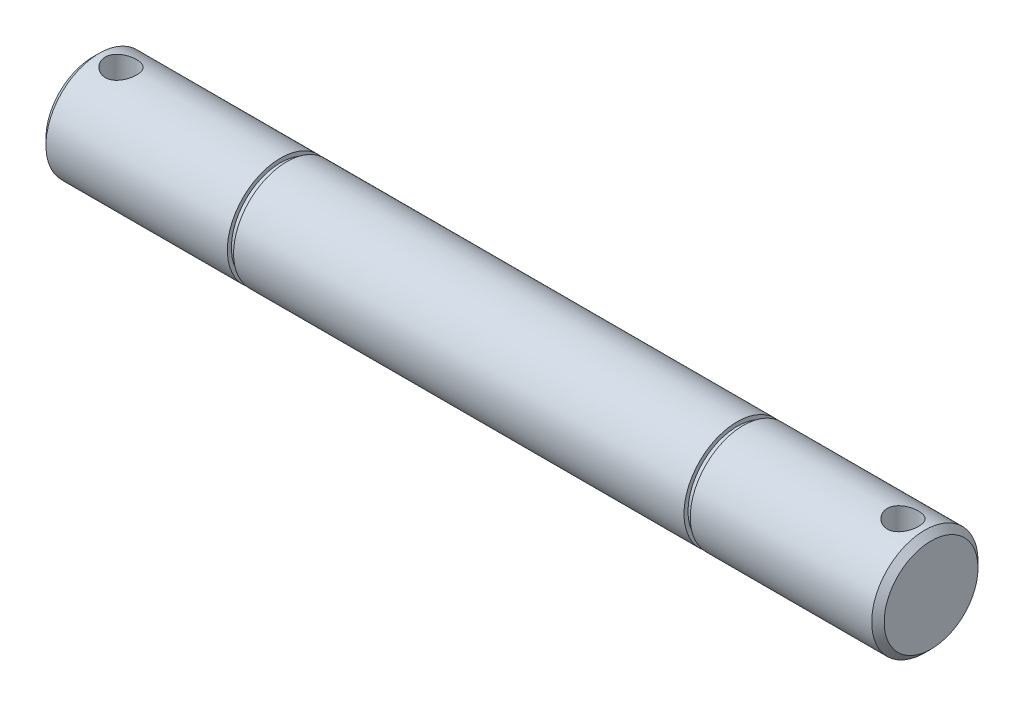
ISO-10303-21;
HEADER;
FILE_DESCRIPTION(('STEP AP214'),'2;1');
FILE_NAME('part.step','',(''),(''),'','','');
FILE_SCHEMA(('AUTOMOTIVE_DESIGN { 1 0 10303 214 1 1 1 1 }'));
ENDSEC;
DATA;
#1=APPLICATION_CONTEXT('core data for automotive mechanical design processes');
#2=APPLICATION_PROTOCOL_DEFINITION('international standard','automotive_design',2000,#1);
#3=PRODUCT_CONTEXT('',#1,'mechanical');
#4=PRODUCT('Part','Part','',(#3));
#5=PRODUCT_RELATED_PRODUCT_CATEGORY('part','',(#4));
#6=PRODUCT_DEFINITION_FORMATION('','',#4);
#7=PRODUCT_DEFINITION_CONTEXT('part definition',#1,'design');
#8=PRODUCT_DEFINITION('design','',#6,#7);
#9=PRODUCT_DEFINITION_SHAPE('','',#8);
#10=(LENGTH_UNIT() NAMED_UNIT(*) SI_UNIT(.MILLI.,.METRE.));
#11=(NAMED_UNIT(*) PLANE_ANGLE_UNIT() SI_UNIT($,.RADIAN.));
#12=(NAMED_UNIT(*) SI_UNIT($,.STERADIAN.) SOLID_ANGLE_UNIT());
#13=UNCERTAINTY_MEASURE_WITH_UNIT(LENGTH_MEASURE(1.E-05),#10,'distance_accuracy_value','');
#14=(GEOMETRIC_REPRESENTATION_CONTEXT(3) GLOBAL_UNCERTAINTY_ASSIGNED_CONTEXT((#13)) GLOBAL_UNIT_ASSIGNED_CONTEXT((#10,
#11,#12)) REPRESENTATION_CONTEXT('',''));
#15=CARTESIAN_POINT('',(0.,0.,0.));
#16=DIRECTION('',(0.,0.,1.));
#17=DIRECTION('',(1.,0.,0.));
#18=AXIS2_PLACEMENT_3D('',#15,#16,#17);
#19=CARTESIAN_POINT('',(134.,0.,0.));
#20=DIRECTION('',(-1.,0.,0.));
#21=DIRECTION('',(0.,0.,1.));
#22=AXIS2_PLACEMENT_3D('',#19,#20,#21);
#23=CYLINDRICAL_SURFACE('',#22,8.5);
#24=CARTESIAN_POINT('',(103.,0.,0.));
#25=DIRECTION('',(1.,0.,0.));
#26=DIRECTION('',(0.,0.,-1.));
#27=AXIS2_PLACEMENT_3D('',#24,#25,#26);
#28=CIRCLE('',#27,8.5);
#29=CARTESIAN_POINT('',(103.,0.,-8.5));
#30=VERTEX_POINT('',#29);
#31=EDGE_CURVE('E101',#30,#30,#28,.T.);
#32=ORIENTED_EDGE('',*,*,#31,.F.);
#33=EDGE_LOOP('',(#32));
#34=FACE_BOUND('',#33,.T.);
#35=CARTESIAN_POINT('',(31.,0.,0.));
#36=DIRECTION('',(1.,0.,0.));
#37=DIRECTION('',(0.,0.,-1.));
#38=AXIS2_PLACEMENT_3D('',#35,#36,#37);
#39=CIRCLE('',#38,8.5);
#40=CARTESIAN_POINT('',(31.,0.,-8.5));
#41=VERTEX_POINT('',#40);
#42=EDGE_CURVE('E111',#41,#41,#39,.T.);
#43=ORIENTED_EDGE('',*,*,#42,.T.);
#44=EDGE_LOOP('',(#43));
#45=FACE_BOUND('',#44,.T.);
#46=ADVANCED_FACE('F34',(#34,#45),#23,.T.);
#47=CARTESIAN_POINT('',(103.,0.,0.));
#48=DIRECTION('',(1.,0.,0.));
#49=DIRECTION('',(0.,0.,-1.));
#50=AXIS2_PLACEMENT_3D('',#47,#48,#49);
#51=PLANE('',#50);
#52=CARTESIAN_POINT('',(103.,0.,0.));
#53=DIRECTION('',(1.,0.,0.));
#54=DIRECTION('',(0.,0.,-1.));
#55=AXIS2_PLACEMENT_3D('',#52,#53,#54);
#56=CIRCLE('',#55,7.85);
#57=CARTESIAN_POINT('',(103.,0.,-7.85));
#58=VERTEX_POINT('',#57);
#59=EDGE_CURVE('E105',#58,#58,#56,.T.);
#60=ORIENTED_EDGE('',*,*,#59,.F.);
#61=EDGE_LOOP('',(#60));
#62=FACE_BOUND('',#61,.T.);
#63=ORIENTED_EDGE('',*,*,#31,.T.);
#64=EDGE_LOOP('',(#63));
#65=FACE_BOUND('',#64,.T.);
#66=ADVANCED_FACE('F146',(#62,#65),#51,.T.);
#67=CARTESIAN_POINT('',(104.,0.,0.));
#68=DIRECTION('',(1.,0.,0.));
#69=DIRECTION('',(0.,0.,-1.));
#70=AXIS2_PLACEMENT_3D('',#67,#68,#69);
#71=PLANE('',#70);
#72=CARTESIAN_POINT('',(104.,0.,0.));
#73=DIRECTION('',(1.,0.,0.));
#74=DIRECTION('',(0.,0.,-1.));
#75=AXIS2_PLACEMENT_3D('',#72,#73,#74);
#76=CIRCLE('',#75,7.85);
#77=CARTESIAN_POINT('',(104.,0.,-7.85));
#78=VERTEX_POINT('',#77);
#79=EDGE_CURVE('E108',#78,#78,#76,.T.);
#80=ORIENTED_EDGE('',*,*,#79,.T.);
#81=EDGE_LOOP('',(#80));
#82=FACE_BOUND('',#81,.T.);
#83=CARTESIAN_POINT('',(104.,0.,0.));
#84=DIRECTION('',(1.,0.,0.));
#85=DIRECTION('',(0.,0.,-1.));
#86=AXIS2_PLACEMENT_3D('',#83,#84,#85);
#87=CIRCLE('',#86,8.5);
#88=CARTESIAN_POINT('',(104.,0.,-8.5));
#89=VERTEX_POINT('',#88);
#90=EDGE_CURVE('E102',#89,#89,#87,.T.);
#91=ORIENTED_EDGE('',*,*,#90,.F.);
#92=EDGE_LOOP('',(#91));
#93=FACE_BOUND('',#92,.T.);
#94=ADVANCED_FACE('F74',(#82,#93),#71,.F.);
#95=CARTESIAN_POINT('',(103.,0.,0.));
#96=DIRECTION('',(1.,0.,0.));
#97=DIRECTION('',(0.,0.,-1.));
#98=AXIS2_PLACEMENT_3D('',#95,#96,#97);
#99=CYLINDRICAL_SURFACE('',#98,7.85);
#100=ORIENTED_EDGE('',*,*,#59,.T.);
#101=EDGE_LOOP('',(#100));
#102=FACE_BOUND('',#101,.T.);
#103=ORIENTED_EDGE('',*,*,#79,.F.);
#104=EDGE_LOOP('',(#103));
#105=FACE_BOUND('',#104,.T.);
#106=ADVANCED_FACE('F173',(#102,#105),#99,.T.);
#107=CARTESIAN_POINT('',(134.,0.,0.));
#108=DIRECTION('',(1.,0.,0.));
#109=DIRECTION('',(0.,0.,-1.));
#110=AXIS2_PLACEMENT_3D('',#107,#108,#109);
#111=PLANE('',#110);
#112=CARTESIAN_POINT('',(134.,0.,0.));
#113=DIRECTION('',(1.,0.,0.));
#114=DIRECTION('',(0.,0.,-1.));
#115=AXIS2_PLACEMENT_3D('',#112,#113,#114);
#116=CIRCLE('',#115,7.49999999999998);
#117=CARTESIAN_POINT('',(134.,0.,-7.49999999999998));
#118=VERTEX_POINT('',#117);
#119=EDGE_CURVE('E89',#118,#118,#116,.T.);
#120=ORIENTED_EDGE('',*,*,#119,.T.);
#121=EDGE_LOOP('',(#120));
#122=FACE_BOUND('',#121,.T.);
#123=ADVANCED_FACE('F82',(#122),#111,.T.);
#124=CARTESIAN_POINT('',(134.,0.,0.));
#125=DIRECTION('',(-1.,0.,0.));
#126=DIRECTION('',(0.,0.,1.));
#127=AXIS2_PLACEMENT_3D('',#124,#125,#126);
#128=CONICAL_SURFACE('',#127,7.49999999999998,0.785398163397445);
#129=CARTESIAN_POINT('',(133.,0.,0.));
#130=DIRECTION('',(1.,0.,0.));
#131=DIRECTION('',(0.,0.,-1.));
#132=AXIS2_PLACEMENT_3D('',#129,#130,#131);
#133=CIRCLE('',#132,8.5);
#134=CARTESIAN_POINT('',(133.,0.,-8.5));
#135=VERTEX_POINT('',#134);
#136=EDGE_CURVE('E98',#135,#135,#133,.F.);
#137=ORIENTED_EDGE('',*,*,#136,.F.);
#138=EDGE_LOOP('',(#137));
#139=FACE_BOUND('',#138,.T.);
#140=ORIENTED_EDGE('',*,*,#119,.F.);
#141=EDGE_LOOP('',(#140));
#142=FACE_BOUND('',#141,.T.);
#143=ADVANCED_FACE('F36',(#139,#142),#128,.T.);
#144=CARTESIAN_POINT('',(129.5,-8.5,0.));
#145=DIRECTION('',(0.,1.,0.));
#146=DIRECTION('',(0.,0.,1.));
#147=AXIS2_PLACEMENT_3D('',#144,#145,#146);
#148=CYLINDRICAL_SURFACE('',#147,2.5);
#149=CARTESIAN_POINT('',(129.5,8.12403840463597,2.49999999999998));
#150=CARTESIAN_POINT('',(129.362873852835,8.12404004769228,2.4999979623633));
#151=CARTESIAN_POINT('',(129.225727422779,8.12754823490024,2.4886794634581));
#152=CARTESIAN_POINT('',(128.955435183069,8.14114853701028,2.44381537502384));
#153=CARTESIAN_POINT('',(128.822290848594,8.15124304925465,2.41026169208829));
#154=CARTESIAN_POINT('',(128.563954163762,8.17677597287571,2.32215786618517));
#155=CARTESIAN_POINT('',(128.438749348537,8.19220574919406,2.26764163496265));
#156=CARTESIAN_POINT('',(128.199233967044,8.22665909626877,2.13927079722774));
#157=CARTESIAN_POINT('',(128.084924895693,8.2456831591037,2.06541354228246));
#158=CARTESIAN_POINT('',(127.866968908219,8.28583044324546,1.89805242493166));
#159=CARTESIAN_POINT('',(127.763702417056,8.30699705220537,1.80406342823789));
#160=CARTESIAN_POINT('',(127.574146555187,8.34867315787303,1.60014717785512));
#161=CARTESIAN_POINT('',(127.487859284143,8.36918257304958,1.49021795590311));
#162=CARTESIAN_POINT('',(127.333071443225,8.40772468697269,1.25484804530032));
#163=CARTESIAN_POINT('',(127.264956976682,8.42570029093119,1.1291432743848));
#164=CARTESIAN_POINT('',(127.15098011761,8.45664648715187,0.867445637031219));
#165=CARTESIAN_POINT('',(127.105113121516,8.46961811474952,0.731454905756552));
#166=CARTESIAN_POINT('',(127.038187024873,8.48878785171354,0.457024005838441));
#167=CARTESIAN_POINT('',(127.016478972153,8.49516280971316,0.318754673888332));
#168=CARTESIAN_POINT('',(126.996436873884,8.50104289513883,0.0403993943316157));
#169=CARTESIAN_POINT('',(126.998098103248,8.50054941131059,-0.0996861803222009));
#170=CARTESIAN_POINT('',(127.024307858585,8.49287406928416,-0.373151342435324));
#171=CARTESIAN_POINT('',(127.048153938971,8.48589749488645,-0.506604918733659));
#172=CARTESIAN_POINT('',(127.116911381903,8.46628800888346,-0.767524842762475));
#173=CARTESIAN_POINT('',(127.161824057814,8.45365474462275,-0.894990816659919));
#174=CARTESIAN_POINT('',(127.271926750607,8.42386378069359,-1.14200961129056));
#175=CARTESIAN_POINT('',(127.337341279239,8.40665632319236,-1.26145611323969));
#176=CARTESIAN_POINT('',(127.486414256184,8.3695475929186,-1.48790420805444));
#177=CARTESIAN_POINT('',(127.570076897098,8.34964570148466,-1.59490293229941));
#178=CARTESIAN_POINT('',(127.756930639675,8.30841132230748,-1.79761108283252));
#179=CARTESIAN_POINT('',(127.860731233555,8.28705315309199,-1.89275419933164));
#180=CARTESIAN_POINT('',(128.083025564592,8.24596298173467,-2.06443893360174));
#181=CARTESIAN_POINT('',(128.201520644982,8.22623112853029,-2.14097884894607));
#182=CARTESIAN_POINT('',(128.451282152895,8.190508316972,-2.27384467334689));
#183=CARTESIAN_POINT('',(128.582652874725,8.17455222141957,-2.32998458403206));
#184=CARTESIAN_POINT('',(128.853560502861,8.14860398612285,-2.41918075403472));
#185=CARTESIAN_POINT('',(128.993094851654,8.13860998943288,-2.45224420125604));
#186=CARTESIAN_POINT('',(129.270995992175,8.12612291499099,-2.4933057101384));
#187=CARTESIAN_POINT('',(129.409224603975,8.12337323394746,-2.50216167789635));
#188=CARTESIAN_POINT('',(129.68519477837,8.12497791371988,-2.49694674077672));
#189=CARTESIAN_POINT('',(129.822936403543,8.12933132587802,-2.48287889750257));
#190=CARTESIAN_POINT('',(130.090495744732,8.14440053150526,-2.43297838264224));
#191=CARTESIAN_POINT('',(130.220425118724,8.15495668098141,-2.39769132906185));
#192=CARTESIAN_POINT('',(130.472512602256,8.18107827684706,-2.30698314161103));
#193=CARTESIAN_POINT('',(130.594669540843,8.19664447589365,-2.25155898239261));
#194=CARTESIAN_POINT('',(130.831252226319,8.23153516861892,-2.12050182351165));
#195=CARTESIAN_POINT('',(130.945394737546,8.25094678118231,-2.04438129566148));
#196=CARTESIAN_POINT('',(131.159599956246,8.29115078956271,-1.87467572806316));
#197=CARTESIAN_POINT('',(131.259659416967,8.31194350216197,-1.7810866725949));
#198=CARTESIAN_POINT('',(131.446575157079,8.35347468056185,-1.5750791637806));
#199=CARTESIAN_POINT('',(131.532824962063,8.37418413333273,-1.46210326579579));
#200=CARTESIAN_POINT('',(131.685152819897,8.4124574775909,-1.22279215701975));
#201=CARTESIAN_POINT('',(131.751231900544,8.43002152933273,-1.09645762735721));
#202=CARTESIAN_POINT('',(131.860706524561,8.45991559483805,-0.834869700798015));
#203=CARTESIAN_POINT('',(131.904272872726,8.47228488292635,-0.699692499333726));
#204=CARTESIAN_POINT('',(131.967936053035,8.49056923502441,-0.423508369003463));
#205=CARTESIAN_POINT('',(131.988039315809,8.49648606745733,-0.282503048450342));
#206=CARTESIAN_POINT('',(132.003732149906,8.50109557993595,-0.00428063265454605));
#207=CARTESIAN_POINT('',(132.000202944985,8.5000479658633,0.132883087997742));
#208=CARTESIAN_POINT('',(131.970826481531,8.49145383826406,0.404579879027487));
#209=CARTESIAN_POINT('',(131.944980404908,8.48390766890344,0.539113088331955));
#210=CARTESIAN_POINT('',(131.872241393431,8.46323443524756,0.800430062071583));
#211=CARTESIAN_POINT('',(131.825560861568,8.45016376169148,0.927277714972615));
#212=CARTESIAN_POINT('',(131.712667454099,8.41979522614636,1.1714084829597));
#213=CARTESIAN_POINT('',(131.64645144208,8.40249668545172,1.28869005835387));
#214=CARTESIAN_POINT('',(131.4939784527,8.36482735062436,1.51431862183006));
#215=CARTESIAN_POINT('',(131.407162667301,8.34437779354528,1.62227473752416));
#216=CARTESIAN_POINT('',(131.216970534231,8.30297459267525,1.82238178255146));
#217=CARTESIAN_POINT('',(131.113589499227,8.28202080763744,1.91452822302219));
#218=CARTESIAN_POINT('',(130.889686707217,8.24128575203089,2.08301441277002));
#219=CARTESIAN_POINT('',(130.768762509931,8.22155447762226,2.15883274542789));
#220=CARTESIAN_POINT('',(130.515322127327,8.18628031678096,2.28897091376095));
#221=CARTESIAN_POINT('',(130.382811943833,8.17073527860536,2.34330180082885));
#222=CARTESIAN_POINT('',(130.126106943865,8.14724808486324,2.42360986971078));
#223=CARTESIAN_POINT('',(130.002780757797,8.13862442212332,2.45217950771623));
#224=CARTESIAN_POINT('',(129.752975082965,8.127019336904,2.49037379107051));
#225=CARTESIAN_POINT('',(129.626496171548,8.12403688894886,2.50000187967971));
#226=CARTESIAN_POINT('',(129.5,8.12403840463597,2.49999999999998));
#227=B_SPLINE_CURVE_WITH_KNOTS('',3,(#149,#150,#151,#152,#153,#154,#155,#156,#157,#158,#159,
#160,#161,#162,#163,#164,#165,#166,#167,#168,#169,#170,#171,#172,#173,#174,#175,#176,#177,#178,
#179,#180,#181,#182,#183,#184,#185,#186,#187,#188,#189,#190,#191,#192,#193,#194,#195,#196,#197,
#198,#199,#200,#201,#202,#203,#204,#205,#206,#207,#208,#209,#210,#211,#212,#213,#214,#215,#216,
#217,#218,#219,#220,#221,#222,#223,#224,#225,#226),.UNSPECIFIED.,.T.,.F.,(4,2,2,2,2,2,2,2,2,2,2,
2,2,2,2,2,2,2,2,2,2,2,2,2,2,2,2,2,2,2,2,2,2,2,2,2,2,2,4),(0.,0.410912099878099,
0.821973850269874,1.23237339254286,1.64282916164921,2.06459109250966,2.48640514599762,
2.91657307890348,3.34665196116875,3.76487622839164,4.18301593513789,4.58835076674873,
4.99371087169738,5.40367496479818,5.81373334874933,6.23900922160106,6.66432399789823,
7.0934246865506,7.52239165832582,7.93594602558849,8.34944516487444,8.75274111013298,
9.15609767062923,9.56993137756285,9.98386033532173,10.4127208011549,10.8415594108245,
11.2670947877504,11.6925135089525,12.1021596149396,12.5117840272457,12.9173245470081,
13.3229302115836,13.7411394840136,14.1594673033651,14.5896395325794,15.0195902276005,
15.3987174767158,15.7777758003975),.UNSPECIFIED.);
#228=CARTESIAN_POINT('',(129.5,8.12403840463597,2.49999999999998));
#229=VERTEX_POINT('',#228);
#230=EDGE_CURVE('E54',#229,#229,#227,.T.);
#231=ORIENTED_EDGE('',*,*,#230,.F.);
#232=EDGE_LOOP('',(#231));
#233=FACE_BOUND('',#232,.T.);
#234=CARTESIAN_POINT('',(129.5,-8.12403840463597,2.49999999999998));
#235=CARTESIAN_POINT('',(129.637126147165,-8.12404004769228,2.4999979623633));
#236=CARTESIAN_POINT('',(129.77427257722,-8.12754823490024,2.4886794634581));
#237=CARTESIAN_POINT('',(130.044564816931,-8.14114853701028,2.44381537502384));
#238=CARTESIAN_POINT('',(130.177709151406,-8.15124304925465,2.41026169208829));
#239=CARTESIAN_POINT('',(130.436045836238,-8.17677597287571,2.32215786618517));
#240=CARTESIAN_POINT('',(130.561250651463,-8.19220574919406,2.26764163496265));
#241=CARTESIAN_POINT('',(130.800766032956,-8.22665909626877,2.13927079722774));
#242=CARTESIAN_POINT('',(130.915075104307,-8.2456831591037,2.06541354228246));
#243=CARTESIAN_POINT('',(131.13303109178,-8.28583044324546,1.89805242493166));
#244=CARTESIAN_POINT('',(131.236297582944,-8.30699705220537,1.80406342823789));
#245=CARTESIAN_POINT('',(131.425853444813,-8.34867315787303,1.60014717785512));
#246=CARTESIAN_POINT('',(131.512140715857,-8.36918257304958,1.49021795590311));
#247=CARTESIAN_POINT('',(131.666928556774,-8.40772468697269,1.25484804530032));
#248=CARTESIAN_POINT('',(131.735043023318,-8.42570029093119,1.1291432743848));
#249=CARTESIAN_POINT('',(131.84901988239,-8.45664648715187,0.867445637031219));
#250=CARTESIAN_POINT('',(131.894886878484,-8.46961811474952,0.731454905756552));
#251=CARTESIAN_POINT('',(131.961812975127,-8.48878785171354,0.457024005838441));
#252=CARTESIAN_POINT('',(131.983521027847,-8.49516280971316,0.318754673888332));
#253=CARTESIAN_POINT('',(132.003563126116,-8.50104289513883,0.0403993943316157));
#254=CARTESIAN_POINT('',(132.001901896752,-8.50054941131059,-0.0996861803222009));
#255=CARTESIAN_POINT('',(131.975692141415,-8.49287406928416,-0.373151342435324));
#256=CARTESIAN_POINT('',(131.951846061029,-8.48589749488645,-0.506604918733659));
#257=CARTESIAN_POINT('',(131.883088618097,-8.46628800888346,-0.767524842762475));
#258=CARTESIAN_POINT('',(131.838175942186,-8.45365474462275,-0.894990816659919));
#259=CARTESIAN_POINT('',(131.728073249393,-8.42386378069359,-1.14200961129056));
#260=CARTESIAN_POINT('',(131.662658720761,-8.40665632319236,-1.26145611323969));
#261=CARTESIAN_POINT('',(131.513585743816,-8.3695475929186,-1.48790420805444));
#262=CARTESIAN_POINT('',(131.429923102902,-8.34964570148466,-1.59490293229941));
#263=CARTESIAN_POINT('',(131.243069360325,-8.30841132230748,-1.79761108283252));
#264=CARTESIAN_POINT('',(131.139268766445,-8.28705315309199,-1.89275419933164));
#265=CARTESIAN_POINT('',(130.916974435408,-8.24596298173467,-2.06443893360174));
#266=CARTESIAN_POINT('',(130.798479355018,-8.22623112853029,-2.14097884894607));
#267=CARTESIAN_POINT('',(130.548717847105,-8.190508316972,-2.27384467334689));
#268=CARTESIAN_POINT('',(130.417347125275,-8.17455222141957,-2.32998458403206));
#269=CARTESIAN_POINT('',(130.146439497139,-8.14860398612285,-2.41918075403472));
#270=CARTESIAN_POINT('',(130.006905148346,-8.13860998943288,-2.45224420125604));
#271=CARTESIAN_POINT('',(129.729004007825,-8.12612291499099,-2.49330571013839));
#272=CARTESIAN_POINT('',(129.590775396025,-8.12337323394746,-2.50216167789635));
#273=CARTESIAN_POINT('',(129.31480522163,-8.12497791371988,-2.49694674077673));
#274=CARTESIAN_POINT('',(129.177063596457,-8.12933132587802,-2.48287889750258));
#275=CARTESIAN_POINT('',(128.909504255267,-8.14440053150526,-2.43297838264224));
#276=CARTESIAN_POINT('',(128.779574881275,-8.15495668098141,-2.39769132906185));
#277=CARTESIAN_POINT('',(128.527487397744,-8.18107827684706,-2.30698314161103));
#278=CARTESIAN_POINT('',(128.405330459157,-8.19664447589365,-2.25155898239261));
#279=CARTESIAN_POINT('',(128.168747773681,-8.23153516861892,-2.12050182351165));
#280=CARTESIAN_POINT('',(128.054605262454,-8.25094678118231,-2.04438129566148));
#281=CARTESIAN_POINT('',(127.840400043754,-8.29115078956271,-1.87467572806316));
#282=CARTESIAN_POINT('',(127.740340583033,-8.31194350216197,-1.7810866725949));
#283=CARTESIAN_POINT('',(127.553424842921,-8.35347468056185,-1.5750791637806));
#284=CARTESIAN_POINT('',(127.467175037937,-8.37418413333273,-1.46210326579579));
#285=CARTESIAN_POINT('',(127.314847180103,-8.4124574775909,-1.22279215701975));
#286=CARTESIAN_POINT('',(127.248768099456,-8.43002152933273,-1.09645762735721));
#287=CARTESIAN_POINT('',(127.139293475439,-8.45991559483805,-0.834869700798015));
#288=CARTESIAN_POINT('',(127.095727127274,-8.47228488292635,-0.699692499333726));
#289=CARTESIAN_POINT('',(127.032063946964,-8.49056923502441,-0.423508369003463));
#290=CARTESIAN_POINT('',(127.011960684191,-8.49648606745733,-0.282503048450342));
#291=CARTESIAN_POINT('',(126.996267850093,-8.50109557993595,-0.00428063265454605));
#292=CARTESIAN_POINT('',(126.999797055015,-8.5000479658633,0.132883087997742));
#293=CARTESIAN_POINT('',(127.029173518469,-8.49145383826406,0.404579879027487));
#294=CARTESIAN_POINT('',(127.055019595092,-8.48390766890344,0.539113088331955));
#295=CARTESIAN_POINT('',(127.127758606569,-8.46323443524756,0.800430062071583));
#296=CARTESIAN_POINT('',(127.174439138432,-8.45016376169148,0.927277714972615));
#297=CARTESIAN_POINT('',(127.287332545901,-8.41979522614636,1.1714084829597));
#298=CARTESIAN_POINT('',(127.35354855792,-8.40249668545172,1.28869005835387));
#299=CARTESIAN_POINT('',(127.506021547299,-8.36482735062436,1.51431862183006));
#300=CARTESIAN_POINT('',(127.592837332699,-8.34437779354528,1.62227473752416));
#301=CARTESIAN_POINT('',(127.783029465769,-8.30297459267525,1.82238178255147));
#302=CARTESIAN_POINT('',(127.886410500773,-8.28202080763744,1.9145282230222));
#303=CARTESIAN_POINT('',(128.110313292783,-8.24128575203089,2.08301441277002));
#304=CARTESIAN_POINT('',(128.231237490069,-8.22155447762226,2.15883274542788));
#305=CARTESIAN_POINT('',(128.484677872673,-8.18628031678096,2.28897091376094));
#306=CARTESIAN_POINT('',(128.617188056167,-8.17073527860536,2.34330180082885));
#307=CARTESIAN_POINT('',(128.873893056135,-8.14724808486324,2.42360986971078));
#308=CARTESIAN_POINT('',(128.997219242203,-8.13862442212332,2.45217950771623));
#309=CARTESIAN_POINT('',(129.247024917035,-8.127019336904,2.49037379107051));
#310=CARTESIAN_POINT('',(129.373503828452,-8.12403688894886,2.50000187967971));
#311=CARTESIAN_POINT('',(129.5,-8.12403840463597,2.49999999999998));
#312=B_SPLINE_CURVE_WITH_KNOTS('',3,(#234,#235,#236,#237,#238,#239,#240,#241,#242,#243,#244,
#245,#246,#247,#248,#249,#250,#251,#252,#253,#254,#255,#256,#257,#258,#259,#260,#261,#262,#263,
#264,#265,#266,#267,#268,#269,#270,#271,#272,#273,#274,#275,#276,#277,#278,#279,#280,#281,#282,
#283,#284,#285,#286,#287,#288,#289,#290,#291,#292,#293,#294,#295,#296,#297,#298,#299,#300,#301,
#302,#303,#304,#305,#306,#307,#308,#309,#310,#311),.UNSPECIFIED.,.T.,.F.,(4,2,2,2,2,2,2,2,2,2,2,
2,2,2,2,2,2,2,2,2,2,2,2,2,2,2,2,2,2,2,2,2,2,2,2,2,2,2,4),(0.,0.410912099878099,
0.821973850269874,1.23237339254286,1.64282916164921,2.06459109250966,2.48640514599762,
2.91657307890348,3.34665196116875,3.76487622839164,4.18301593513789,4.58835076674873,
4.99371087169738,5.40367496479818,5.81373334874933,6.23900922160106,6.66432399789823,
7.0934246865506,7.52239165832582,7.93594602558844,8.34944516487444,8.75274111013298,
9.15609767062923,9.56993137756285,9.98386033532173,10.4127208011549,10.8415594108245,
11.2670947877504,11.6925135089525,12.1021596149396,12.5117840272457,12.9173245470081,
13.3229302115836,13.7411394840136,14.1594673033651,14.5896395325794,15.0195902276005,
15.3987174767158,15.7777758003975),.UNSPECIFIED.);
#313=CARTESIAN_POINT('',(129.5,-8.12403840463597,2.49999999999998));
#314=VERTEX_POINT('',#313);
#315=EDGE_CURVE('E50',#314,#314,#312,.T.);
#316=ORIENTED_EDGE('',*,*,#315,.F.);
#317=EDGE_LOOP('',(#316));
#318=FACE_BOUND('',#317,.T.);
#319=ADVANCED_FACE('F76',(#233,#318),#148,.F.);
#320=ORIENTED_EDGE('',*,*,#90,.T.);
#321=EDGE_LOOP('',(#320));
#322=FACE_BOUND('',#321,.T.);
#323=ORIENTED_EDGE('',*,*,#315,.T.);
#324=EDGE_LOOP('',(#323));
#325=FACE_BOUND('',#324,.T.);
#326=ORIENTED_EDGE('',*,*,#230,.T.);
#327=EDGE_LOOP('',(#326));
#328=FACE_BOUND('',#327,.T.);
#329=ORIENTED_EDGE('',*,*,#136,.T.);
#330=EDGE_LOOP('',(#329));
#331=FACE_BOUND('',#330,.T.);
#332=ADVANCED_FACE('F64',(#322,#325,#328,#331),#23,.T.);
#333=CARTESIAN_POINT('',(31.,0.,0.));
#334=DIRECTION('',(-1.,0.,0.));
#335=DIRECTION('',(0.,0.,-1.));
#336=AXIS2_PLACEMENT_3D('',#333,#334,#335);
#337=PLANE('',#336);
#338=ORIENTED_EDGE('',*,*,#42,.F.);
#339=EDGE_LOOP('',(#338));
#340=FACE_BOUND('',#339,.T.);
#341=CARTESIAN_POINT('',(31.,0.,0.));
#342=DIRECTION('',(1.,0.,0.));
#343=DIRECTION('',(0.,0.,-1.));
#344=AXIS2_PLACEMENT_3D('',#341,#342,#343);
#345=CIRCLE('',#344,7.85);
#346=CARTESIAN_POINT('',(31.,0.,-7.85));
#347=VERTEX_POINT('',#346);
#348=EDGE_CURVE('E117',#347,#347,#345,.T.);
#349=ORIENTED_EDGE('',*,*,#348,.T.);
#350=EDGE_LOOP('',(#349));
#351=FACE_BOUND('',#350,.T.);
#352=ADVANCED_FACE('F126',(#340,#351),#337,.T.);
#353=CARTESIAN_POINT('',(30.,0.,0.));
#354=DIRECTION('',(-1.,0.,0.));
#355=DIRECTION('',(0.,0.,-1.));
#356=AXIS2_PLACEMENT_3D('',#353,#354,#355);
#357=PLANE('',#356);
#358=CARTESIAN_POINT('',(30.,0.,0.));
#359=DIRECTION('',(1.,0.,0.));
#360=DIRECTION('',(0.,0.,-1.));
#361=AXIS2_PLACEMENT_3D('',#358,#359,#360);
#362=CIRCLE('',#361,8.5);
#363=CARTESIAN_POINT('',(30.,0.,-8.5));
#364=VERTEX_POINT('',#363);
#365=EDGE_CURVE('E114',#364,#364,#362,.T.);
#366=ORIENTED_EDGE('',*,*,#365,.T.);
#367=EDGE_LOOP('',(#366));
#368=FACE_BOUND('',#367,.T.);
#369=CARTESIAN_POINT('',(30.,0.,0.));
#370=DIRECTION('',(1.,0.,0.));
#371=DIRECTION('',(0.,0.,-1.));
#372=AXIS2_PLACEMENT_3D('',#369,#370,#371);
#373=CIRCLE('',#372,7.85);
#374=CARTESIAN_POINT('',(30.,0.,-7.85));
#375=VERTEX_POINT('',#374);
#376=EDGE_CURVE('E120',#375,#375,#373,.T.);
#377=ORIENTED_EDGE('',*,*,#376,.F.);
#378=EDGE_LOOP('',(#377));
#379=FACE_BOUND('',#378,.T.);
#380=ADVANCED_FACE('F132',(#368,#379),#357,.F.);
#381=CARTESIAN_POINT('',(31.,0.,0.));
#382=DIRECTION('',(-1.,0.,0.));
#383=DIRECTION('',(0.,0.,1.));
#384=AXIS2_PLACEMENT_3D('',#381,#382,#383);
#385=CYLINDRICAL_SURFACE('',#384,7.85);
#386=ORIENTED_EDGE('',*,*,#348,.F.);
#387=EDGE_LOOP('',(#386));
#388=FACE_BOUND('',#387,.T.);
#389=ORIENTED_EDGE('',*,*,#376,.T.);
#390=EDGE_LOOP('',(#389));
#391=FACE_BOUND('',#390,.T.);
#392=ADVANCED_FACE('F128',(#388,#391),#385,.T.);
#393=CARTESIAN_POINT('',(0.,0.,0.));
#394=DIRECTION('',(1.,0.,0.));
#395=DIRECTION('',(0.,0.,-1.));
#396=AXIS2_PLACEMENT_3D('',#393,#394,#395);
#397=PLANE('',#396);
#398=CARTESIAN_POINT('',(0.,0.,0.));
#399=DIRECTION('',(1.,0.,0.));
#400=DIRECTION('',(0.,0.,-1.));
#401=AXIS2_PLACEMENT_3D('',#398,#399,#400);
#402=CIRCLE('',#401,7.50000000000003);
#403=CARTESIAN_POINT('',(0.,0.,-7.50000000000003));
#404=VERTEX_POINT('',#403);
#405=EDGE_CURVE('E92',#404,#404,#402,.F.);
#406=ORIENTED_EDGE('',*,*,#405,.T.);
#407=EDGE_LOOP('',(#406));
#408=FACE_BOUND('',#407,.T.);
#409=ADVANCED_FACE('F131',(#408),#397,.F.);
#410=CARTESIAN_POINT('',(0.999999999999973,0.,0.));
#411=DIRECTION('',(1.,0.,0.));
#412=DIRECTION('',(0.,0.,-1.));
#413=AXIS2_PLACEMENT_3D('',#410,#411,#412);
#414=CONICAL_SURFACE('',#413,8.5,0.785398163397445);
#415=ORIENTED_EDGE('',*,*,#405,.F.);
#416=EDGE_LOOP('',(#415));
#417=FACE_BOUND('',#416,.T.);
#418=CARTESIAN_POINT('',(0.999999999999973,0.,0.));
#419=DIRECTION('',(1.,0.,0.));
#420=DIRECTION('',(0.,0.,-1.));
#421=AXIS2_PLACEMENT_3D('',#418,#419,#420);
#422=CIRCLE('',#421,8.5);
#423=CARTESIAN_POINT('',(0.999999999999973,0.,-8.5));
#424=VERTEX_POINT('',#423);
#425=EDGE_CURVE('E95',#424,#424,#422,.T.);
#426=ORIENTED_EDGE('',*,*,#425,.F.);
#427=EDGE_LOOP('',(#426));
#428=FACE_BOUND('',#427,.T.);
#429=ADVANCED_FACE('F72',(#417,#428),#414,.T.);
#430=CARTESIAN_POINT('',(4.5,-8.5,0.));
#431=DIRECTION('',(0.,1.,0.));
#432=DIRECTION('',(0.,0.,1.));
#433=AXIS2_PLACEMENT_3D('',#430,#431,#432);
#434=CYLINDRICAL_SURFACE('',#433,2.5);
#435=CARTESIAN_POINT('',(4.5,8.12403840463596,2.5));
#436=CARTESIAN_POINT('',(4.36287385283519,8.12404004769227,2.49999796236332));
#437=CARTESIAN_POINT('',(4.2257274227795,8.12754823490024,2.48867946345813));
#438=CARTESIAN_POINT('',(3.95543518306861,8.14114853701027,2.44381537502387));
#439=CARTESIAN_POINT('',(3.82229084859404,8.15124304925464,2.41026169208831));
#440=CARTESIAN_POINT('',(3.56395416376238,8.1767759728757,2.32215786618519));
#441=CARTESIAN_POINT('',(3.43874934853738,8.19220574919406,2.26764163496267));
#442=CARTESIAN_POINT('',(3.19923396704368,8.22665909626877,2.13927079722776));
#443=CARTESIAN_POINT('',(3.08492489569286,8.2456831591037,2.06541354228249));
#444=CARTESIAN_POINT('',(2.86696890821953,8.28583044324545,1.89805242493169));
#445=CARTESIAN_POINT('',(2.763702417056,8.30699705220536,1.80406342823792));
#446=CARTESIAN_POINT('',(2.57414655518681,8.34867315787303,1.60014717785515));
#447=CARTESIAN_POINT('',(2.48785928414272,8.36918257304957,1.49021795590314));
#448=CARTESIAN_POINT('',(2.33307144322551,8.40772468697269,1.25484804530033));
#449=CARTESIAN_POINT('',(2.26495697668239,8.42570029093119,1.12914327438481));
#450=CARTESIAN_POINT('',(2.15098011760978,8.45664648715187,0.867445637031225));
#451=CARTESIAN_POINT('',(2.10511312151591,8.46961811474953,0.731454905756559));
#452=CARTESIAN_POINT('',(2.03818702487282,8.48878785171354,0.457024005838449));
#453=CARTESIAN_POINT('',(2.01647897215264,8.49516280971316,0.31875467388834));
#454=CARTESIAN_POINT('',(1.99643687388364,8.50104289513883,0.0403993943316246));
#455=CARTESIAN_POINT('',(1.99809810324784,8.50054941131059,-0.0996861803221906));
#456=CARTESIAN_POINT('',(2.02430785858504,8.49287406928416,-0.373151342435313));
#457=CARTESIAN_POINT('',(2.04815393897056,8.48589749488645,-0.506604918733648));
#458=CARTESIAN_POINT('',(2.11691138190254,8.46628800888346,-0.767524842762462));
#459=CARTESIAN_POINT('',(2.1618240578136,8.45365474462275,-0.894990816659904));
#460=CARTESIAN_POINT('',(2.27192675060702,8.42386378069359,-1.14200961129054));
#461=CARTESIAN_POINT('',(2.33734127923917,8.40665632319236,-1.26145611323968));
#462=CARTESIAN_POINT('',(2.48641425618388,8.3695475929186,-1.48790420805442));
#463=CARTESIAN_POINT('',(2.57007689709796,8.34964570148467,-1.59490293229939));
#464=CARTESIAN_POINT('',(2.75693063967522,8.30841132230748,-1.79761108283251));
#465=CARTESIAN_POINT('',(2.86073123355472,8.28705315309199,-1.89275419933163));
#466=CARTESIAN_POINT('',(3.08302556459168,8.24596298173467,-2.06443893360174));
#467=CARTESIAN_POINT('',(3.20152064498191,8.2262311285303,-2.14097884894606));
#468=CARTESIAN_POINT('',(3.45128215289504,8.190508316972,-2.27384467334688));
#469=CARTESIAN_POINT('',(3.58265287472504,8.17455222141957,-2.32998458403205));
#470=CARTESIAN_POINT('',(3.85356050286112,8.14860398612285,-2.41918075403471));
#471=CARTESIAN_POINT('',(3.99309485165376,8.13860998943288,-2.45224420125603));
#472=CARTESIAN_POINT('',(4.27099599217508,8.12612291499099,-2.49330571013838));
#473=CARTESIAN_POINT('',(4.40922460397478,8.12337323394746,-2.50216167789634));
#474=CARTESIAN_POINT('',(4.68519477836979,8.12497791371988,-2.49694674077672));
#475=CARTESIAN_POINT('',(4.82293640354272,8.12933132587802,-2.48287889750257));
#476=CARTESIAN_POINT('',(5.09049574473253,8.14440053150526,-2.43297838264223));
#477=CARTESIAN_POINT('',(5.22042511872446,8.15495668098142,-2.39769132906183));
#478=CARTESIAN_POINT('',(5.47251260225621,8.18107827684707,-2.30698314161101));
#479=CARTESIAN_POINT('',(5.59466954084263,8.19664447589366,-2.25155898239259));
#480=CARTESIAN_POINT('',(5.83125222631923,8.23153516861892,-2.12050182351162));
#481=CARTESIAN_POINT('',(5.94539473754603,8.25094678118232,-2.04438129566145));
#482=CARTESIAN_POINT('',(6.15959995624599,8.29115078956272,-1.87467572806313));
#483=CARTESIAN_POINT('',(6.25965941696733,8.31194350216197,-1.78108667259488));
#484=CARTESIAN_POINT('',(6.44657515707877,8.35347468056185,-1.57507916378059));
#485=CARTESIAN_POINT('',(6.53282496206256,8.37418413333273,-1.46210326579578));
#486=CARTESIAN_POINT('',(6.68515281989699,8.4124574775909,-1.22279215701974));
#487=CARTESIAN_POINT('',(6.75123190054355,8.43002152933274,-1.0964576273572));
#488=CARTESIAN_POINT('',(6.86070652456102,8.45991559483806,-0.834869700798005));
#489=CARTESIAN_POINT('',(6.90427287272618,8.47228488292635,-0.699692499333713));
#490=CARTESIAN_POINT('',(6.96793605303548,8.49056923502441,-0.423508369003445));
#491=CARTESIAN_POINT('',(6.98803931580861,8.49648606745733,-0.282503048450322));
#492=CARTESIAN_POINT('',(7.00373214990651,8.50109557993595,-0.00428063265452394));
#493=CARTESIAN_POINT('',(7.00020294498525,8.5000479658633,0.132883087997764));
#494=CARTESIAN_POINT('',(6.97082648153114,8.49145383826406,0.404579879027508));
#495=CARTESIAN_POINT('',(6.9449804049082,8.48390766890344,0.539113088331976));
#496=CARTESIAN_POINT('',(6.87224139343081,8.46323443524756,0.800430062071601));
#497=CARTESIAN_POINT('',(6.825560861568,8.45016376169148,0.927277714972632));
#498=CARTESIAN_POINT('',(6.71266745409868,8.41979522614635,1.17140848295972));
#499=CARTESIAN_POINT('',(6.6464514420796,8.40249668545172,1.28869005835388));
#500=CARTESIAN_POINT('',(6.49397845270049,8.36482735062435,1.51431862183009));
#501=CARTESIAN_POINT('',(6.40716266730101,8.34437779354527,1.6222747375242));
#502=CARTESIAN_POINT('',(6.21697053423111,8.30297459267524,1.8223817825515));
#503=CARTESIAN_POINT('',(6.11358949922716,8.28202080763743,1.91452822302222));
#504=CARTESIAN_POINT('',(5.88968670721729,8.24128575203089,2.08301441277003));
#505=CARTESIAN_POINT('',(5.76876250993104,8.22155447762226,2.1588327454279));
#506=CARTESIAN_POINT('',(5.51532212732722,8.18628031678096,2.28897091376096));
#507=CARTESIAN_POINT('',(5.38281194383291,8.17073527860536,2.34330180082886));
#508=CARTESIAN_POINT('',(5.12610694386492,8.14724808486323,2.42360986971079));
#509=CARTESIAN_POINT('',(5.00278075779745,8.13862442212332,2.45217950771625));
#510=CARTESIAN_POINT('',(4.75297508296518,8.127019336904,2.49037379107052));
#511=CARTESIAN_POINT('',(4.62649617154774,8.12403688894886,2.50000187967972));
#512=CARTESIAN_POINT('',(4.5,8.12403840463596,2.5));
#513=B_SPLINE_CURVE_WITH_KNOTS('',3,(#435,#436,#437,#438,#439,#440,#441,#442,#443,#444,#445,
#446,#447,#448,#449,#450,#451,#452,#453,#454,#455,#456,#457,#458,#459,#460,#461,#462,#463,#464,
#465,#466,#467,#468,#469,#470,#471,#472,#473,#474,#475,#476,#477,#478,#479,#480,#481,#482,#483,
#484,#485,#486,#487,#488,#489,#490,#491,#492,#493,#494,#495,#496,#497,#498,#499,#500,#501,#502,
#503,#504,#505,#506,#507,#508,#509,#510,#511,#512),.UNSPECIFIED.,.T.,.F.,(4,2,2,2,2,2,2,2,2,2,2,
2,2,2,2,2,2,2,2,2,2,2,2,2,2,2,2,2,2,2,2,2,2,2,2,2,2,2,4),(0.,0.410912099878095,
0.821973850269873,1.23237339254286,1.64282916164919,2.06459109250964,2.48640514599761,
2.91657307890349,3.34665196116877,3.76487622839165,4.18301593513789,4.58835076674873,
4.99371087169739,5.40367496479819,5.81373334874933,6.23900922160109,6.66432399789825,
7.09342468655064,7.52239165832583,7.93594602558847,8.34944516487445,8.75274111013304,
9.15609767062928,9.56993137756289,9.98386033532174,10.4127208011549,10.8415594108246,
11.2670947877504,11.6925135089525,12.1021596149396,12.5117840272457,12.9173245470081,
13.3229302115836,13.7411394840136,14.1594673033652,14.5896395325794,15.0195902276005,
15.3987174767158,15.7777758003975),.UNSPECIFIED.);
#514=CARTESIAN_POINT('',(4.5,8.12403840463596,2.5));
#515=VERTEX_POINT('',#514);
#516=EDGE_CURVE('E46',#515,#515,#513,.T.);
#517=ORIENTED_EDGE('',*,*,#516,.F.);
#518=EDGE_LOOP('',(#517));
#519=FACE_BOUND('',#518,.T.);
#520=CARTESIAN_POINT('',(4.5,-8.12403840463596,2.5));
#521=CARTESIAN_POINT('',(4.63712614716481,-8.12404004769227,2.49999796236332));
#522=CARTESIAN_POINT('',(4.7742725772205,-8.12754823490024,2.48867946345813));
#523=CARTESIAN_POINT('',(5.04456481693139,-8.14114853701027,2.44381537502387));
#524=CARTESIAN_POINT('',(5.17770915140595,-8.15124304925464,2.41026169208831));
#525=CARTESIAN_POINT('',(5.43604583623762,-8.1767759728757,2.32215786618519));
#526=CARTESIAN_POINT('',(5.56125065146261,-8.19220574919406,2.26764163496267));
#527=CARTESIAN_POINT('',(5.80076603295632,-8.22665909626877,2.13927079722776));
#528=CARTESIAN_POINT('',(5.91507510430714,-8.2456831591037,2.06541354228249));
#529=CARTESIAN_POINT('',(6.13303109178047,-8.28583044324545,1.89805242493169));
#530=CARTESIAN_POINT('',(6.236297582944,-8.30699705220536,1.80406342823792));
#531=CARTESIAN_POINT('',(6.42585344481319,-8.34867315787303,1.60014717785515));
#532=CARTESIAN_POINT('',(6.51214071585728,-8.36918257304957,1.49021795590314));
#533=CARTESIAN_POINT('',(6.66692855677449,-8.40772468697269,1.25484804530033));
#534=CARTESIAN_POINT('',(6.73504302331761,-8.42570029093119,1.12914327438481));
#535=CARTESIAN_POINT('',(6.84901988239022,-8.45664648715187,0.867445637031226));
#536=CARTESIAN_POINT('',(6.89488687848409,-8.46961811474953,0.73145490575656));
#537=CARTESIAN_POINT('',(6.96181297512718,-8.48878785171354,0.457024005838449));
#538=CARTESIAN_POINT('',(6.98352102784736,-8.49516280971316,0.31875467388834));
#539=CARTESIAN_POINT('',(7.00356312611636,-8.50104289513883,0.0403993943316251));
#540=CARTESIAN_POINT('',(7.00190189675216,-8.50054941131059,-0.0996861803221901));
#541=CARTESIAN_POINT('',(6.97569214141496,-8.49287406928416,-0.373151342435312));
#542=CARTESIAN_POINT('',(6.95184606102944,-8.48589749488645,-0.506604918733647));
#543=CARTESIAN_POINT('',(6.88308861809746,-8.46628800888346,-0.767524842762461));
#544=CARTESIAN_POINT('',(6.8381759421864,-8.45365474462275,-0.894990816659903));
#545=CARTESIAN_POINT('',(6.72807324939298,-8.42386378069359,-1.14200961129054));
#546=CARTESIAN_POINT('',(6.66265872076083,-8.40665632319236,-1.26145611323968));
#547=CARTESIAN_POINT('',(6.51358574381612,-8.3695475929186,-1.48790420805442));
#548=CARTESIAN_POINT('',(6.42992310290204,-8.34964570148467,-1.59490293229939));
#549=CARTESIAN_POINT('',(6.24306936032478,-8.30841132230748,-1.79761108283251));
#550=CARTESIAN_POINT('',(6.13926876644528,-8.28705315309199,-1.89275419933163));
#551=CARTESIAN_POINT('',(5.91697443540832,-8.24596298173467,-2.06443893360174));
#552=CARTESIAN_POINT('',(5.79847935501809,-8.2262311285303,-2.14097884894606));
#553=CARTESIAN_POINT('',(5.54871784710496,-8.190508316972,-2.27384467334688));
#554=CARTESIAN_POINT('',(5.41734712527496,-8.17455222141957,-2.32998458403205));
#555=CARTESIAN_POINT('',(5.14643949713888,-8.14860398612285,-2.41918075403471));
#556=CARTESIAN_POINT('',(5.00690514834624,-8.13860998943288,-2.45224420125603));
#557=CARTESIAN_POINT('',(4.72900400782492,-8.12612291499099,-2.49330571013838));
#558=CARTESIAN_POINT('',(4.59077539602522,-8.12337323394746,-2.50216167789634));
#559=CARTESIAN_POINT('',(4.31480522163021,-8.12497791371988,-2.49694674077672));
#560=CARTESIAN_POINT('',(4.17706359645728,-8.12933132587802,-2.48287889750257));
#561=CARTESIAN_POINT('',(3.90950425526747,-8.14440053150526,-2.43297838264223));
#562=CARTESIAN_POINT('',(3.77957488127554,-8.15495668098142,-2.39769132906183));
#563=CARTESIAN_POINT('',(3.52748739774379,-8.18107827684707,-2.30698314161101));
#564=CARTESIAN_POINT('',(3.40533045915737,-8.19664447589366,-2.25155898239259));
#565=CARTESIAN_POINT('',(3.16874777368077,-8.23153516861892,-2.12050182351162));
#566=CARTESIAN_POINT('',(3.05460526245397,-8.25094678118232,-2.04438129566145));
#567=CARTESIAN_POINT('',(2.84040004375401,-8.29115078956272,-1.87467572806313));
#568=CARTESIAN_POINT('',(2.74034058303267,-8.31194350216197,-1.78108667259488));
#569=CARTESIAN_POINT('',(2.55342484292123,-8.35347468056185,-1.57507916378059));
#570=CARTESIAN_POINT('',(2.46717503793744,-8.37418413333273,-1.46210326579578));
#571=CARTESIAN_POINT('',(2.31484718010301,-8.4124574775909,-1.22279215701974));
#572=CARTESIAN_POINT('',(2.24876809945645,-8.43002152933273,-1.0964576273572));
#573=CARTESIAN_POINT('',(2.13929347543898,-8.45991559483805,-0.834869700798007));
#574=CARTESIAN_POINT('',(2.09572712727382,-8.47228488292635,-0.699692499333716));
#575=CARTESIAN_POINT('',(2.03206394696452,-8.49056923502441,-0.423508369003448));
#576=CARTESIAN_POINT('',(2.01196068419139,-8.49648606745733,-0.282503048450324));
#577=CARTESIAN_POINT('',(1.99626785009349,-8.50109557993595,-0.00428063265452572));
#578=CARTESIAN_POINT('',(1.99979705501476,-8.5000479658633,0.132883087997762));
#579=CARTESIAN_POINT('',(2.02917351846886,-8.49145383826406,0.404579879027506));
#580=CARTESIAN_POINT('',(2.0550195950918,-8.48390766890344,0.539113088331974));
#581=CARTESIAN_POINT('',(2.12775860656919,-8.46323443524756,0.800430062071601));
#582=CARTESIAN_POINT('',(2.174439138432,-8.45016376169147,0.927277714972632));
#583=CARTESIAN_POINT('',(2.28733254590132,-8.41979522614635,1.17140848295972));
#584=CARTESIAN_POINT('',(2.3535485579204,-8.40249668545172,1.28869005835388));
#585=CARTESIAN_POINT('',(2.5060215472995,-8.36482735062435,1.51431862183009));
#586=CARTESIAN_POINT('',(2.59283733269899,-8.34437779354527,1.6222747375242));
#587=CARTESIAN_POINT('',(2.78302946576889,-8.30297459267524,1.8223817825515));
#588=CARTESIAN_POINT('',(2.88641050077284,-8.28202080763743,1.91452822302222));
#589=CARTESIAN_POINT('',(3.11031329278271,-8.24128575203089,2.08301441277003));
#590=CARTESIAN_POINT('',(3.23123749006896,-8.22155447762226,2.1588327454279));
#591=CARTESIAN_POINT('',(3.48467787267278,-8.18628031678096,2.28897091376096));
#592=CARTESIAN_POINT('',(3.61718805616709,-8.17073527860536,2.34330180082886));
#593=CARTESIAN_POINT('',(3.87389305613508,-8.14724808486323,2.42360986971079));
#594=CARTESIAN_POINT('',(3.99721924220255,-8.13862442212332,2.45217950771625));
#595=CARTESIAN_POINT('',(4.24702491703482,-8.127019336904,2.49037379107052));
#596=CARTESIAN_POINT('',(4.37350382845226,-8.12403688894886,2.50000187967972));
#597=CARTESIAN_POINT('',(4.5,-8.12403840463596,2.5));
#598=B_SPLINE_CURVE_WITH_KNOTS('',3,(#520,#521,#522,#523,#524,#525,#526,#527,#528,#529,#530,
#531,#532,#533,#534,#535,#536,#537,#538,#539,#540,#541,#542,#543,#544,#545,#546,#547,#548,#549,
#550,#551,#552,#553,#554,#555,#556,#557,#558,#559,#560,#561,#562,#563,#564,#565,#566,#567,#568,
#569,#570,#571,#572,#573,#574,#575,#576,#577,#578,#579,#580,#581,#582,#583,#584,#585,#586,#587,
#588,#589,#590,#591,#592,#593,#594,#595,#596,#597),.UNSPECIFIED.,.T.,.F.,(4,2,2,2,2,2,2,2,2,2,2,
2,2,2,2,2,2,2,2,2,2,2,2,2,2,2,2,2,2,2,2,2,2,2,2,2,2,2,4),(0.,0.410912099878096,
0.821973850269873,1.23237339254286,1.64282916164919,2.06459109250964,2.48640514599761,
2.91657307890349,3.34665196116877,3.76487622839166,4.18301593513789,4.58835076674874,
4.99371087169739,5.40367496479819,5.81373334874933,6.23900922160109,6.66432399789825,
7.09342468655064,7.52239165832583,7.93594602558847,8.34944516487445,8.75274111013304,
9.15609767062928,9.56993137756289,9.98386033532174,10.4127208011549,10.8415594108246,
11.2670947877504,11.6925135089525,12.1021596149396,12.5117840272457,12.9173245470081,
13.3229302115836,13.7411394840136,14.1594673033652,14.5896395325794,15.0195902276005,
15.3987174767158,15.7777758003975),.UNSPECIFIED.);
#599=CARTESIAN_POINT('',(4.5,-8.12403840463596,2.5));
#600=VERTEX_POINT('',#599);
#601=EDGE_CURVE('E10',#600,#600,#598,.T.);
#602=ORIENTED_EDGE('',*,*,#601,.F.);
#603=EDGE_LOOP('',(#602));
#604=FACE_BOUND('',#603,.T.);
#605=ADVANCED_FACE('F67',(#519,#604),#434,.F.);
#606=ORIENTED_EDGE('',*,*,#365,.F.);
#607=EDGE_LOOP('',(#606));
#608=FACE_BOUND('',#607,.T.);
#609=ORIENTED_EDGE('',*,*,#601,.T.);
#610=EDGE_LOOP('',(#609));
#611=FACE_BOUND('',#610,.T.);
#612=ORIENTED_EDGE('',*,*,#516,.T.);
#613=EDGE_LOOP('',(#612));
#614=FACE_BOUND('',#613,.T.);
#615=ORIENTED_EDGE('',*,*,#425,.T.);
#616=EDGE_LOOP('',(#615));
#617=FACE_BOUND('',#616,.T.);
#618=ADVANCED_FACE('F71',(#608,#611,#614,#617),#23,.T.);
#619=CLOSED_SHELL('',(#46,#66,#94,#106,#123,#143,#319,#332,#352,#380,#392,#409,#429,#605,#618));
#620=MANIFOLD_SOLID_BREP('B2',#619);
#621=ADVANCED_BREP_SHAPE_REPRESENTATION('',(#18,#620),#14);
#622=SHAPE_DEFINITION_REPRESENTATION(#9,#621);
ENDSEC;
END-ISO-10303-21;
